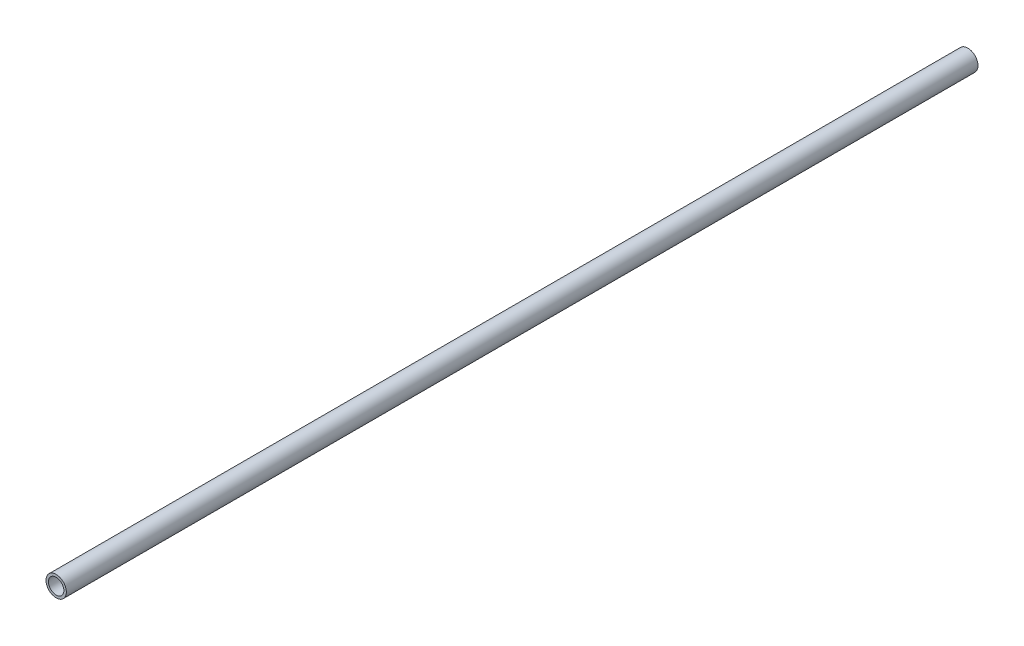
ISO-10303-21;
HEADER;
FILE_DESCRIPTION(('STEP AP214'),'2;1');
FILE_NAME('part.step','',(''),(''),'','','');
FILE_SCHEMA(('AUTOMOTIVE_DESIGN { 1 0 10303 214 1 1 1 1 }'));
ENDSEC;
DATA;
#1=APPLICATION_CONTEXT('core data for automotive mechanical design processes');
#2=APPLICATION_PROTOCOL_DEFINITION('international standard','automotive_design',2000,#1);
#3=PRODUCT_CONTEXT('',#1,'mechanical');
#4=PRODUCT('Part','Part','',(#3));
#5=PRODUCT_RELATED_PRODUCT_CATEGORY('part','',(#4));
#6=PRODUCT_DEFINITION_FORMATION('','',#4);
#7=PRODUCT_DEFINITION_CONTEXT('part definition',#1,'design');
#8=PRODUCT_DEFINITION('design','',#6,#7);
#9=PRODUCT_DEFINITION_SHAPE('','',#8);
#10=(LENGTH_UNIT() NAMED_UNIT(*) SI_UNIT(.MILLI.,.METRE.));
#11=(NAMED_UNIT(*) PLANE_ANGLE_UNIT() SI_UNIT($,.RADIAN.));
#12=(NAMED_UNIT(*) SI_UNIT($,.STERADIAN.) SOLID_ANGLE_UNIT());
#13=UNCERTAINTY_MEASURE_WITH_UNIT(LENGTH_MEASURE(1.E-05),#10,'distance_accuracy_value','');
#14=(GEOMETRIC_REPRESENTATION_CONTEXT(3) GLOBAL_UNCERTAINTY_ASSIGNED_CONTEXT((#13)) GLOBAL_UNIT_ASSIGNED_CONTEXT((#10,
#11,#12)) REPRESENTATION_CONTEXT('',''));
#15=CARTESIAN_POINT('',(0.,0.,0.));
#16=DIRECTION('',(0.,0.,1.));
#17=DIRECTION('',(1.,0.,0.));
#18=AXIS2_PLACEMENT_3D('',#15,#16,#17);
#19=CARTESIAN_POINT('',(0.,0.,1500.));
#20=DIRECTION('',(0.,0.,-1.));
#21=DIRECTION('',(-1.,0.,0.));
#22=AXIS2_PLACEMENT_3D('',#19,#20,#21);
#23=CYLINDRICAL_SURFACE('',#22,16.75);
#24=CARTESIAN_POINT('',(0.,0.,1500.));
#25=DIRECTION('',(0.,0.,1.));
#26=DIRECTION('',(1.,0.,0.));
#27=AXIS2_PLACEMENT_3D('',#24,#25,#26);
#28=CIRCLE('',#27,16.75);
#29=CARTESIAN_POINT('',(16.75,0.,1500.));
#30=VERTEX_POINT('',#29);
#31=EDGE_CURVE('E10',#30,#30,#28,.T.);
#32=ORIENTED_EDGE('',*,*,#31,.F.);
#33=EDGE_LOOP('',(#32));
#34=FACE_BOUND('',#33,.T.);
#35=CARTESIAN_POINT('',(0.,0.,0.));
#36=DIRECTION('',(0.,0.,1.));
#37=DIRECTION('',(1.,0.,0.));
#38=AXIS2_PLACEMENT_3D('',#35,#36,#37);
#39=CIRCLE('',#38,16.75);
#40=CARTESIAN_POINT('',(16.75,0.,0.));
#41=VERTEX_POINT('',#40);
#42=EDGE_CURVE('E37',#41,#41,#39,.T.);
#43=ORIENTED_EDGE('',*,*,#42,.T.);
#44=EDGE_LOOP('',(#43));
#45=FACE_BOUND('',#44,.T.);
#46=ADVANCED_FACE('F34',(#34,#45),#23,.T.);
#47=CARTESIAN_POINT('',(0.,0.,1500.));
#48=DIRECTION('',(0.,0.,1.));
#49=DIRECTION('',(1.,0.,0.));
#50=AXIS2_PLACEMENT_3D('',#47,#48,#49);
#51=PLANE('',#50);
#52=CARTESIAN_POINT('',(0.,0.,1500.));
#53=DIRECTION('',(0.,0.,1.));
#54=DIRECTION('',(1.,0.,0.));
#55=AXIS2_PLACEMENT_3D('',#52,#53,#54);
#56=CIRCLE('',#55,12.7);
#57=CARTESIAN_POINT('',(12.7,0.,1500.));
#58=VERTEX_POINT('',#57);
#59=EDGE_CURVE('E46',#58,#58,#56,.T.);
#60=ORIENTED_EDGE('',*,*,#59,.F.);
#61=EDGE_LOOP('',(#60));
#62=FACE_BOUND('',#61,.T.);
#63=ORIENTED_EDGE('',*,*,#31,.T.);
#64=EDGE_LOOP('',(#63));
#65=FACE_BOUND('',#64,.T.);
#66=ADVANCED_FACE('F61',(#62,#65),#51,.T.);
#67=CARTESIAN_POINT('',(0.,0.,0.));
#68=DIRECTION('',(0.,0.,1.));
#69=DIRECTION('',(1.,0.,0.));
#70=AXIS2_PLACEMENT_3D('',#67,#68,#69);
#71=PLANE('',#70);
#72=CARTESIAN_POINT('',(0.,0.,0.));
#73=DIRECTION('',(0.,0.,1.));
#74=DIRECTION('',(1.,0.,0.));
#75=AXIS2_PLACEMENT_3D('',#72,#73,#74);
#76=CIRCLE('',#75,12.7);
#77=CARTESIAN_POINT('',(12.7,0.,0.));
#78=VERTEX_POINT('',#77);
#79=EDGE_CURVE('E44',#78,#78,#76,.T.);
#80=ORIENTED_EDGE('',*,*,#79,.T.);
#81=EDGE_LOOP('',(#80));
#82=FACE_BOUND('',#81,.T.);
#83=ORIENTED_EDGE('',*,*,#42,.F.);
#84=EDGE_LOOP('',(#83));
#85=FACE_BOUND('',#84,.T.);
#86=ADVANCED_FACE('F52',(#82,#85),#71,.F.);
#87=CARTESIAN_POINT('',(0.,0.,0.));
#88=DIRECTION('',(0.,0.,1.));
#89=DIRECTION('',(1.,0.,0.));
#90=AXIS2_PLACEMENT_3D('',#87,#88,#89);
#91=CYLINDRICAL_SURFACE('',#90,12.7);
#92=ORIENTED_EDGE('',*,*,#79,.F.);
#93=EDGE_LOOP('',(#92));
#94=FACE_BOUND('',#93,.T.);
#95=ORIENTED_EDGE('',*,*,#59,.T.);
#96=EDGE_LOOP('',(#95));
#97=FACE_BOUND('',#96,.T.);
#98=ADVANCED_FACE('F55',(#94,#97),#91,.F.);
#99=CLOSED_SHELL('',(#46,#66,#86,#98));
#100=MANIFOLD_SOLID_BREP('B2',#99);
#101=ADVANCED_BREP_SHAPE_REPRESENTATION('',(#18,#100),#14);
#102=SHAPE_DEFINITION_REPRESENTATION(#9,#101);
ENDSEC;
END-ISO-10303-21;
